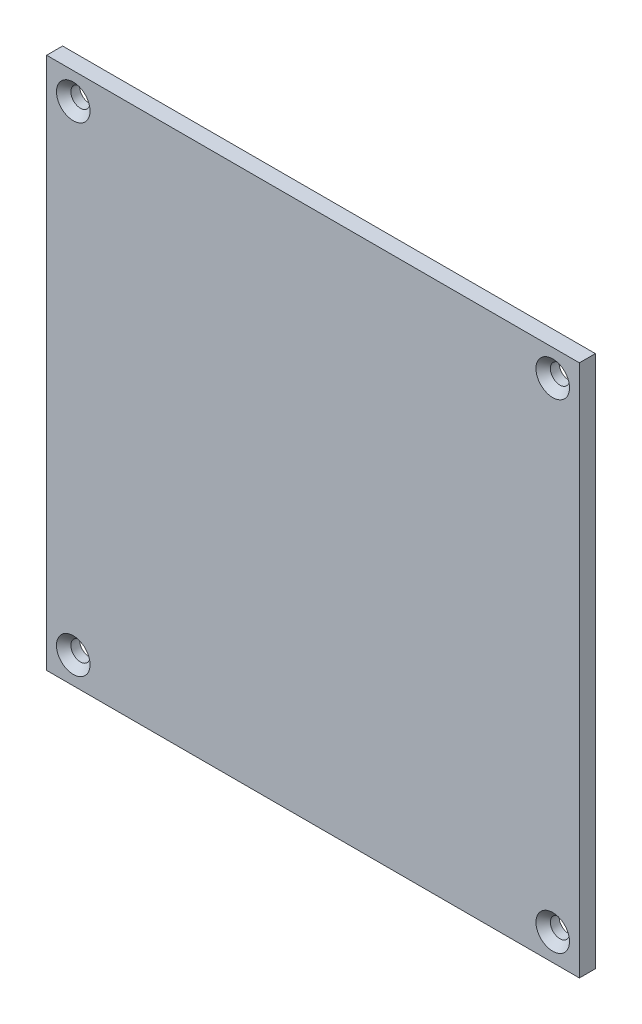
ISO-10303-21;
HEADER;
FILE_DESCRIPTION(('STEP AP214'),'2;1');
FILE_NAME('part.step','',(''),(''),'','','');
FILE_SCHEMA(('AUTOMOTIVE_DESIGN { 1 0 10303 214 1 1 1 1 }'));
ENDSEC;
DATA;
#1=APPLICATION_CONTEXT('core data for automotive mechanical design processes');
#2=APPLICATION_PROTOCOL_DEFINITION('international standard','automotive_design',2000,#1);
#3=PRODUCT_CONTEXT('',#1,'mechanical');
#4=PRODUCT('Part','Part','',(#3));
#5=PRODUCT_RELATED_PRODUCT_CATEGORY('part','',(#4));
#6=PRODUCT_DEFINITION_FORMATION('','',#4);
#7=PRODUCT_DEFINITION_CONTEXT('part definition',#1,'design');
#8=PRODUCT_DEFINITION('design','',#6,#7);
#9=PRODUCT_DEFINITION_SHAPE('','',#8);
#10=(LENGTH_UNIT() NAMED_UNIT(*) SI_UNIT(.MILLI.,.METRE.));
#11=(NAMED_UNIT(*) PLANE_ANGLE_UNIT() SI_UNIT($,.RADIAN.));
#12=(NAMED_UNIT(*) SI_UNIT($,.STERADIAN.) SOLID_ANGLE_UNIT());
#13=UNCERTAINTY_MEASURE_WITH_UNIT(LENGTH_MEASURE(1.E-05),#10,'distance_accuracy_value','');
#14=(GEOMETRIC_REPRESENTATION_CONTEXT(3) GLOBAL_UNCERTAINTY_ASSIGNED_CONTEXT((#13)) GLOBAL_UNIT_ASSIGNED_CONTEXT((#10,
#11,#12)) REPRESENTATION_CONTEXT('',''));
#15=CARTESIAN_POINT('',(0.,0.,0.));
#16=DIRECTION('',(0.,0.,1.));
#17=DIRECTION('',(1.,0.,0.));
#18=AXIS2_PLACEMENT_3D('',#15,#16,#17);
#19=CARTESIAN_POINT('',(0.,0.,3.));
#20=DIRECTION('',(1.,0.,0.));
#21=DIRECTION('',(0.,1.,0.));
#22=AXIS2_PLACEMENT_3D('',#19,#20,#21);
#23=PLANE('',#22);
#24=DIRECTION('',(0.,-1.,0.));
#25=VECTOR('',#24,1.);
#26=CARTESIAN_POINT('',(0.,0.,0.));
#27=LINE('',#26,#25);
#28=CARTESIAN_POINT('',(0.,100.,0.));
#29=VERTEX_POINT('',#28);
#30=CARTESIAN_POINT('',(0.,0.,0.));
#31=VERTEX_POINT('',#30);
#32=EDGE_CURVE('E97',#29,#31,#27,.T.);
#33=ORIENTED_EDGE('',*,*,#32,.T.);
#34=DIRECTION('',(0.,0.,-1.));
#35=VECTOR('',#34,1.);
#36=CARTESIAN_POINT('',(0.,0.,3.));
#37=LINE('',#36,#35);
#38=CARTESIAN_POINT('',(0.,0.,3.));
#39=VERTEX_POINT('',#38);
#40=EDGE_CURVE('E11',#39,#31,#37,.T.);
#41=ORIENTED_EDGE('',*,*,#40,.F.);
#42=DIRECTION('',(0.,-1.,0.));
#43=VECTOR('',#42,1.);
#44=CARTESIAN_POINT('',(0.,0.,3.));
#45=LINE('',#44,#43);
#46=CARTESIAN_POINT('',(0.,100.,3.));
#47=VERTEX_POINT('',#46);
#48=EDGE_CURVE('E85',#47,#39,#45,.T.);
#49=ORIENTED_EDGE('',*,*,#48,.F.);
#50=DIRECTION('',(0.,0.,-1.));
#51=VECTOR('',#50,1.);
#52=CARTESIAN_POINT('',(0.,100.,3.));
#53=LINE('',#52,#51);
#54=EDGE_CURVE('E93',#47,#29,#53,.T.);
#55=ORIENTED_EDGE('',*,*,#54,.T.);
#56=EDGE_LOOP('',(#33,#41,#49,#55));
#57=FACE_BOUND('',#56,.T.);
#58=ADVANCED_FACE('F34',(#57),#23,.F.);
#59=CARTESIAN_POINT('',(0.,0.,3.));
#60=DIRECTION('',(0.,1.,0.));
#61=DIRECTION('',(0.,0.,1.));
#62=AXIS2_PLACEMENT_3D('',#59,#60,#61);
#63=PLANE('',#62);
#64=DIRECTION('',(1.,0.,0.));
#65=VECTOR('',#64,1.);
#66=CARTESIAN_POINT('',(0.,0.,0.));
#67=LINE('',#66,#65);
#68=CARTESIAN_POINT('',(100.,0.,0.));
#69=VERTEX_POINT('',#68);
#70=EDGE_CURVE('E89',#31,#69,#67,.T.);
#71=ORIENTED_EDGE('',*,*,#70,.T.);
#72=DIRECTION('',(0.,0.,-1.));
#73=VECTOR('',#72,1.);
#74=CARTESIAN_POINT('',(100.,0.,3.));
#75=LINE('',#74,#73);
#76=CARTESIAN_POINT('',(100.,0.,3.));
#77=VERTEX_POINT('',#76);
#78=EDGE_CURVE('E42',#77,#69,#75,.T.);
#79=ORIENTED_EDGE('',*,*,#78,.F.);
#80=DIRECTION('',(1.,0.,0.));
#81=VECTOR('',#80,1.);
#82=CARTESIAN_POINT('',(0.,0.,3.));
#83=LINE('',#82,#81);
#84=EDGE_CURVE('E80',#39,#77,#83,.T.);
#85=ORIENTED_EDGE('',*,*,#84,.F.);
#86=ORIENTED_EDGE('',*,*,#40,.T.);
#87=EDGE_LOOP('',(#71,#79,#85,#86));
#88=FACE_BOUND('',#87,.T.);
#89=ADVANCED_FACE('F88',(#88),#63,.F.);
#90=CARTESIAN_POINT('',(100.,0.,3.));
#91=DIRECTION('',(-1.,0.,0.));
#92=DIRECTION('',(0.,-1.,0.));
#93=AXIS2_PLACEMENT_3D('',#90,#91,#92);
#94=PLANE('',#93);
#95=DIRECTION('',(0.,1.,0.));
#96=VECTOR('',#95,1.);
#97=CARTESIAN_POINT('',(100.,0.,0.));
#98=LINE('',#97,#96);
#99=CARTESIAN_POINT('',(100.,100.,0.));
#100=VERTEX_POINT('',#99);
#101=EDGE_CURVE('E67',#69,#100,#98,.T.);
#102=ORIENTED_EDGE('',*,*,#101,.T.);
#103=DIRECTION('',(0.,0.,-1.));
#104=VECTOR('',#103,1.);
#105=CARTESIAN_POINT('',(100.,100.,3.));
#106=LINE('',#105,#104);
#107=CARTESIAN_POINT('',(100.,100.,3.));
#108=VERTEX_POINT('',#107);
#109=EDGE_CURVE('E90',#108,#100,#106,.T.);
#110=ORIENTED_EDGE('',*,*,#109,.F.);
#111=DIRECTION('',(0.,1.,0.));
#112=VECTOR('',#111,1.);
#113=CARTESIAN_POINT('',(100.,0.,3.));
#114=LINE('',#113,#112);
#115=EDGE_CURVE('E83',#77,#108,#114,.T.);
#116=ORIENTED_EDGE('',*,*,#115,.F.);
#117=ORIENTED_EDGE('',*,*,#78,.T.);
#118=EDGE_LOOP('',(#102,#110,#116,#117));
#119=FACE_BOUND('',#118,.T.);
#120=ADVANCED_FACE('F91',(#119),#94,.F.);
#121=CARTESIAN_POINT('',(0.,100.,3.));
#122=DIRECTION('',(0.,-1.,0.));
#123=DIRECTION('',(0.,0.,-1.));
#124=AXIS2_PLACEMENT_3D('',#121,#122,#123);
#125=PLANE('',#124);
#126=DIRECTION('',(-1.,0.,0.));
#127=VECTOR('',#126,1.);
#128=CARTESIAN_POINT('',(0.,100.,0.));
#129=LINE('',#128,#127);
#130=EDGE_CURVE('E73',#100,#29,#129,.T.);
#131=ORIENTED_EDGE('',*,*,#130,.T.);
#132=ORIENTED_EDGE('',*,*,#54,.F.);
#133=DIRECTION('',(-1.,0.,0.));
#134=VECTOR('',#133,1.);
#135=CARTESIAN_POINT('',(0.,100.,3.));
#136=LINE('',#135,#134);
#137=EDGE_CURVE('E50',#108,#47,#136,.T.);
#138=ORIENTED_EDGE('',*,*,#137,.F.);
#139=ORIENTED_EDGE('',*,*,#109,.T.);
#140=EDGE_LOOP('',(#131,#132,#138,#139));
#141=FACE_BOUND('',#140,.T.);
#142=ADVANCED_FACE('F105',(#141),#125,.F.);
#143=CARTESIAN_POINT('',(0.,0.,3.));
#144=DIRECTION('',(0.,0.,-1.));
#145=DIRECTION('',(-1.,0.,0.));
#146=AXIS2_PLACEMENT_3D('',#143,#144,#145);
#147=PLANE('',#146);
#148=CARTESIAN_POINT('',(4.99999999999999,95.,3.));
#149=DIRECTION('',(0.,0.,1.));
#150=DIRECTION('',(1.,0.,0.));
#151=AXIS2_PLACEMENT_3D('',#148,#149,#150);
#152=CIRCLE('',#151,3.15);
#153=CARTESIAN_POINT('',(8.14999999999999,95.,3.));
#154=VERTEX_POINT('',#153);
#155=EDGE_CURVE('E143',#154,#154,#152,.T.);
#156=ORIENTED_EDGE('',*,*,#155,.F.);
#157=EDGE_LOOP('',(#156));
#158=FACE_BOUND('',#157,.T.);
#159=CARTESIAN_POINT('',(95.,95.,3.));
#160=DIRECTION('',(0.,0.,1.));
#161=DIRECTION('',(1.,0.,0.));
#162=AXIS2_PLACEMENT_3D('',#159,#160,#161);
#163=CIRCLE('',#162,3.15);
#164=CARTESIAN_POINT('',(98.15,95.,3.));
#165=VERTEX_POINT('',#164);
#166=EDGE_CURVE('E134',#165,#165,#163,.T.);
#167=ORIENTED_EDGE('',*,*,#166,.F.);
#168=EDGE_LOOP('',(#167));
#169=FACE_BOUND('',#168,.T.);
#170=CARTESIAN_POINT('',(95.,5.,3.));
#171=DIRECTION('',(0.,0.,1.));
#172=DIRECTION('',(1.,0.,0.));
#173=AXIS2_PLACEMENT_3D('',#170,#171,#172);
#174=CIRCLE('',#173,3.15);
#175=CARTESIAN_POINT('',(98.15,5.,3.));
#176=VERTEX_POINT('',#175);
#177=EDGE_CURVE('E125',#176,#176,#174,.T.);
#178=ORIENTED_EDGE('',*,*,#177,.F.);
#179=EDGE_LOOP('',(#178));
#180=FACE_BOUND('',#179,.T.);
#181=CARTESIAN_POINT('',(4.99999999999999,5.,3.));
#182=DIRECTION('',(0.,0.,1.));
#183=DIRECTION('',(1.,0.,0.));
#184=AXIS2_PLACEMENT_3D('',#181,#182,#183);
#185=CIRCLE('',#184,3.15);
#186=CARTESIAN_POINT('',(8.14999999999999,5.,3.));
#187=VERTEX_POINT('',#186);
#188=EDGE_CURVE('E116',#187,#187,#185,.T.);
#189=ORIENTED_EDGE('',*,*,#188,.F.);
#190=EDGE_LOOP('',(#189));
#191=FACE_BOUND('',#190,.T.);
#192=ORIENTED_EDGE('',*,*,#48,.T.);
#193=ORIENTED_EDGE('',*,*,#84,.T.);
#194=ORIENTED_EDGE('',*,*,#115,.T.);
#195=ORIENTED_EDGE('',*,*,#137,.T.);
#196=EDGE_LOOP('',(#192,#193,#194,#195));
#197=FACE_BOUND('',#196,.T.);
#198=ADVANCED_FACE('F81',(#158,#169,#180,#191,#197),#147,.F.);
#199=CARTESIAN_POINT('',(0.,0.,0.));
#200=DIRECTION('',(0.,0.,-1.));
#201=DIRECTION('',(-1.,0.,0.));
#202=AXIS2_PLACEMENT_3D('',#199,#200,#201);
#203=PLANE('',#202);
#204=CARTESIAN_POINT('',(4.99999999999999,95.,0.));
#205=DIRECTION('',(0.,0.,1.));
#206=DIRECTION('',(1.,0.,0.));
#207=AXIS2_PLACEMENT_3D('',#204,#205,#206);
#208=CIRCLE('',#207,1.8);
#209=CARTESIAN_POINT('',(6.79999999999999,95.,0.));
#210=VERTEX_POINT('',#209);
#211=EDGE_CURVE('E137',#210,#210,#208,.T.);
#212=ORIENTED_EDGE('',*,*,#211,.T.);
#213=EDGE_LOOP('',(#212));
#214=FACE_BOUND('',#213,.T.);
#215=CARTESIAN_POINT('',(95.,95.,0.));
#216=DIRECTION('',(0.,0.,1.));
#217=DIRECTION('',(1.,0.,0.));
#218=AXIS2_PLACEMENT_3D('',#215,#216,#217);
#219=CIRCLE('',#218,1.8);
#220=CARTESIAN_POINT('',(96.8,95.,0.));
#221=VERTEX_POINT('',#220);
#222=EDGE_CURVE('E128',#221,#221,#219,.T.);
#223=ORIENTED_EDGE('',*,*,#222,.T.);
#224=EDGE_LOOP('',(#223));
#225=FACE_BOUND('',#224,.T.);
#226=CARTESIAN_POINT('',(95.,5.,0.));
#227=DIRECTION('',(0.,0.,1.));
#228=DIRECTION('',(1.,0.,0.));
#229=AXIS2_PLACEMENT_3D('',#226,#227,#228);
#230=CIRCLE('',#229,1.8);
#231=CARTESIAN_POINT('',(96.8,5.,0.));
#232=VERTEX_POINT('',#231);
#233=EDGE_CURVE('E119',#232,#232,#230,.T.);
#234=ORIENTED_EDGE('',*,*,#233,.T.);
#235=EDGE_LOOP('',(#234));
#236=FACE_BOUND('',#235,.T.);
#237=CARTESIAN_POINT('',(4.99999999999999,5.,0.));
#238=DIRECTION('',(0.,0.,1.));
#239=DIRECTION('',(1.,0.,0.));
#240=AXIS2_PLACEMENT_3D('',#237,#238,#239);
#241=CIRCLE('',#240,1.8);
#242=CARTESIAN_POINT('',(6.79999999999999,5.,0.));
#243=VERTEX_POINT('',#242);
#244=EDGE_CURVE('E100',#243,#243,#241,.T.);
#245=ORIENTED_EDGE('',*,*,#244,.T.);
#246=EDGE_LOOP('',(#245));
#247=FACE_BOUND('',#246,.T.);
#248=ORIENTED_EDGE('',*,*,#32,.F.);
#249=ORIENTED_EDGE('',*,*,#130,.F.);
#250=ORIENTED_EDGE('',*,*,#101,.F.);
#251=ORIENTED_EDGE('',*,*,#70,.F.);
#252=EDGE_LOOP('',(#248,#249,#250,#251));
#253=FACE_BOUND('',#252,.T.);
#254=ADVANCED_FACE('F108',(#214,#225,#236,#247,#253),#203,.T.);
#255=CARTESIAN_POINT('',(4.99999999999999,5.,3.));
#256=DIRECTION('',(0.,0.,1.));
#257=DIRECTION('',(1.,0.,0.));
#258=AXIS2_PLACEMENT_3D('',#255,#256,#257);
#259=CYLINDRICAL_SURFACE('',#258,1.8);
#260=ORIENTED_EDGE('',*,*,#244,.F.);
#261=EDGE_LOOP('',(#260));
#262=FACE_BOUND('',#261,.T.);
#263=CARTESIAN_POINT('',(4.99999999999999,5.,1.65));
#264=DIRECTION('',(0.,0.,1.));
#265=DIRECTION('',(1.,0.,0.));
#266=AXIS2_PLACEMENT_3D('',#263,#264,#265);
#267=CIRCLE('',#266,1.8);
#268=CARTESIAN_POINT('',(6.79999999999999,5.,1.65));
#269=VERTEX_POINT('',#268);
#270=EDGE_CURVE('E113',#269,#269,#267,.T.);
#271=ORIENTED_EDGE('',*,*,#270,.T.);
#272=EDGE_LOOP('',(#271));
#273=FACE_BOUND('',#272,.T.);
#274=ADVANCED_FACE('F161',(#262,#273),#259,.F.);
#275=CARTESIAN_POINT('',(4.99999999999999,5.,3.));
#276=DIRECTION('',(0.,0.,1.));
#277=DIRECTION('',(1.,0.,0.));
#278=AXIS2_PLACEMENT_3D('',#275,#276,#277);
#279=CONICAL_SURFACE('',#278,3.15,0.785398163397449);
#280=ORIENTED_EDGE('',*,*,#270,.F.);
#281=EDGE_LOOP('',(#280));
#282=FACE_BOUND('',#281,.T.);
#283=ORIENTED_EDGE('',*,*,#188,.T.);
#284=EDGE_LOOP('',(#283));
#285=FACE_BOUND('',#284,.T.);
#286=ADVANCED_FACE('F158',(#282,#285),#279,.F.);
#287=CARTESIAN_POINT('',(95.,5.,3.));
#288=DIRECTION('',(0.,0.,1.));
#289=DIRECTION('',(1.,0.,0.));
#290=AXIS2_PLACEMENT_3D('',#287,#288,#289);
#291=CYLINDRICAL_SURFACE('',#290,1.8);
#292=ORIENTED_EDGE('',*,*,#233,.F.);
#293=EDGE_LOOP('',(#292));
#294=FACE_BOUND('',#293,.T.);
#295=CARTESIAN_POINT('',(95.,5.,1.65));
#296=DIRECTION('',(0.,0.,1.));
#297=DIRECTION('',(1.,0.,0.));
#298=AXIS2_PLACEMENT_3D('',#295,#296,#297);
#299=CIRCLE('',#298,1.8);
#300=CARTESIAN_POINT('',(96.8,5.,1.65));
#301=VERTEX_POINT('',#300);
#302=EDGE_CURVE('E122',#301,#301,#299,.T.);
#303=ORIENTED_EDGE('',*,*,#302,.T.);
#304=EDGE_LOOP('',(#303));
#305=FACE_BOUND('',#304,.T.);
#306=ADVANCED_FACE('F160',(#294,#305),#291,.F.);
#307=CARTESIAN_POINT('',(95.,5.,3.));
#308=DIRECTION('',(0.,0.,1.));
#309=DIRECTION('',(1.,0.,0.));
#310=AXIS2_PLACEMENT_3D('',#307,#308,#309);
#311=CONICAL_SURFACE('',#310,3.15,0.78539816339745);
#312=ORIENTED_EDGE('',*,*,#302,.F.);
#313=EDGE_LOOP('',(#312));
#314=FACE_BOUND('',#313,.T.);
#315=ORIENTED_EDGE('',*,*,#177,.T.);
#316=EDGE_LOOP('',(#315));
#317=FACE_BOUND('',#316,.T.);
#318=ADVANCED_FACE('F168',(#314,#317),#311,.F.);
#319=CARTESIAN_POINT('',(95.,95.,3.));
#320=DIRECTION('',(0.,0.,1.));
#321=DIRECTION('',(1.,0.,0.));
#322=AXIS2_PLACEMENT_3D('',#319,#320,#321);
#323=CYLINDRICAL_SURFACE('',#322,1.8);
#324=ORIENTED_EDGE('',*,*,#222,.F.);
#325=EDGE_LOOP('',(#324));
#326=FACE_BOUND('',#325,.T.);
#327=CARTESIAN_POINT('',(95.,95.,1.65));
#328=DIRECTION('',(0.,0.,1.));
#329=DIRECTION('',(1.,0.,0.));
#330=AXIS2_PLACEMENT_3D('',#327,#328,#329);
#331=CIRCLE('',#330,1.8);
#332=CARTESIAN_POINT('',(96.8,95.,1.65));
#333=VERTEX_POINT('',#332);
#334=EDGE_CURVE('E131',#333,#333,#331,.T.);
#335=ORIENTED_EDGE('',*,*,#334,.T.);
#336=EDGE_LOOP('',(#335));
#337=FACE_BOUND('',#336,.T.);
#338=ADVANCED_FACE('F202',(#326,#337),#323,.F.);
#339=CARTESIAN_POINT('',(95.,95.,3.));
#340=DIRECTION('',(0.,0.,1.));
#341=DIRECTION('',(1.,0.,0.));
#342=AXIS2_PLACEMENT_3D('',#339,#340,#341);
#343=CONICAL_SURFACE('',#342,3.15,0.78539816339745);
#344=ORIENTED_EDGE('',*,*,#334,.F.);
#345=EDGE_LOOP('',(#344));
#346=FACE_BOUND('',#345,.T.);
#347=ORIENTED_EDGE('',*,*,#166,.T.);
#348=EDGE_LOOP('',(#347));
#349=FACE_BOUND('',#348,.T.);
#350=ADVANCED_FACE('F207',(#346,#349),#343,.F.);
#351=CARTESIAN_POINT('',(4.99999999999999,95.,3.));
#352=DIRECTION('',(0.,0.,1.));
#353=DIRECTION('',(1.,0.,0.));
#354=AXIS2_PLACEMENT_3D('',#351,#352,#353);
#355=CYLINDRICAL_SURFACE('',#354,1.8);
#356=ORIENTED_EDGE('',*,*,#211,.F.);
#357=EDGE_LOOP('',(#356));
#358=FACE_BOUND('',#357,.T.);
#359=CARTESIAN_POINT('',(4.99999999999999,95.,1.65));
#360=DIRECTION('',(0.,0.,1.));
#361=DIRECTION('',(1.,0.,0.));
#362=AXIS2_PLACEMENT_3D('',#359,#360,#361);
#363=CIRCLE('',#362,1.8);
#364=CARTESIAN_POINT('',(6.79999999999999,95.,1.65));
#365=VERTEX_POINT('',#364);
#366=EDGE_CURVE('E140',#365,#365,#363,.T.);
#367=ORIENTED_EDGE('',*,*,#366,.T.);
#368=EDGE_LOOP('',(#367));
#369=FACE_BOUND('',#368,.T.);
#370=ADVANCED_FACE('F213',(#358,#369),#355,.F.);
#371=CARTESIAN_POINT('',(4.99999999999999,95.,3.));
#372=DIRECTION('',(0.,0.,1.));
#373=DIRECTION('',(1.,0.,0.));
#374=AXIS2_PLACEMENT_3D('',#371,#372,#373);
#375=CONICAL_SURFACE('',#374,3.15,0.785398163397449);
#376=ORIENTED_EDGE('',*,*,#366,.F.);
#377=EDGE_LOOP('',(#376));
#378=FACE_BOUND('',#377,.T.);
#379=ORIENTED_EDGE('',*,*,#155,.T.);
#380=EDGE_LOOP('',(#379));
#381=FACE_BOUND('',#380,.T.);
#382=ADVANCED_FACE('F147',(#378,#381),#375,.F.);
#383=CLOSED_SHELL('',(#58,#89,#120,#142,#198,#254,#274,#286,#306,#318,#338,#350,#370,#382));
#384=MANIFOLD_SOLID_BREP('B2',#383);
#385=ADVANCED_BREP_SHAPE_REPRESENTATION('',(#18,#384),#14);
#386=SHAPE_DEFINITION_REPRESENTATION(#9,#385);
ENDSEC;
END-ISO-10303-21;
